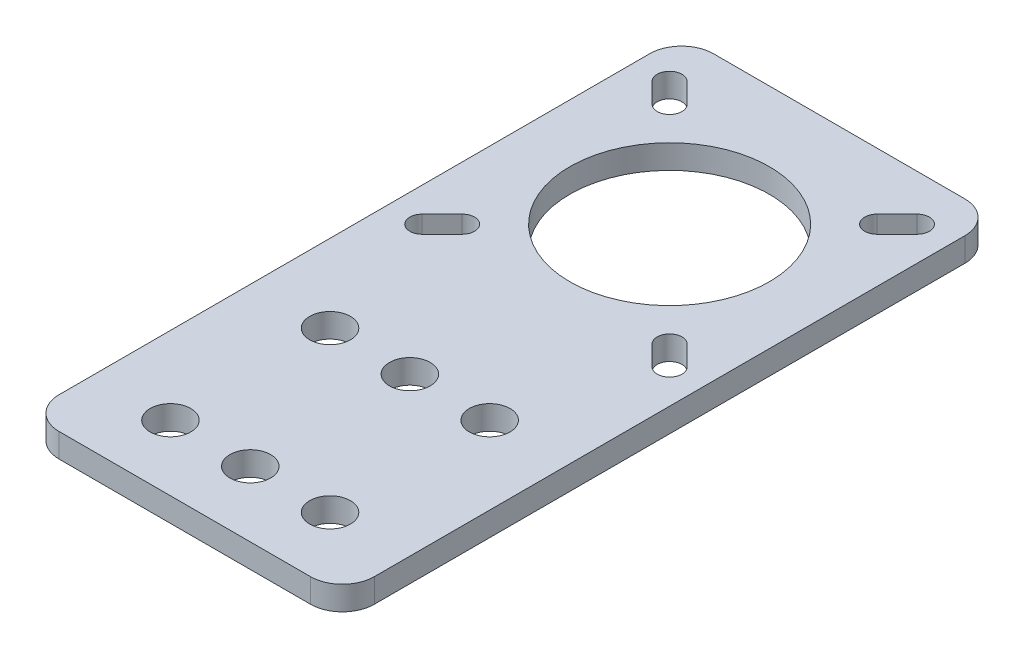
ISO-10303-21;
HEADER;
FILE_DESCRIPTION(('STEP AP214'),'2;1');
FILE_NAME('part.step','',(''),(''),'','','');
FILE_SCHEMA(('AUTOMOTIVE_DESIGN { 1 0 10303 214 1 1 1 1 }'));
ENDSEC;
DATA;
#1=APPLICATION_CONTEXT('core data for automotive mechanical design processes');
#2=APPLICATION_PROTOCOL_DEFINITION('international standard','automotive_design',2000,#1);
#3=PRODUCT_CONTEXT('',#1,'mechanical');
#4=PRODUCT('Part','Part','',(#3));
#5=PRODUCT_RELATED_PRODUCT_CATEGORY('part','',(#4));
#6=PRODUCT_DEFINITION_FORMATION('','',#4);
#7=PRODUCT_DEFINITION_CONTEXT('part definition',#1,'design');
#8=PRODUCT_DEFINITION('design','',#6,#7);
#9=PRODUCT_DEFINITION_SHAPE('','',#8);
#10=(LENGTH_UNIT() NAMED_UNIT(*) SI_UNIT(.MILLI.,.METRE.));
#11=(NAMED_UNIT(*) PLANE_ANGLE_UNIT() SI_UNIT($,.RADIAN.));
#12=(NAMED_UNIT(*) SI_UNIT($,.STERADIAN.) SOLID_ANGLE_UNIT());
#13=UNCERTAINTY_MEASURE_WITH_UNIT(LENGTH_MEASURE(1.E-05),#10,'distance_accuracy_value','');
#14=(GEOMETRIC_REPRESENTATION_CONTEXT(3) GLOBAL_UNCERTAINTY_ASSIGNED_CONTEXT((#13)) GLOBAL_UNIT_ASSIGNED_CONTEXT((#10,
#11,#12)) REPRESENTATION_CONTEXT('',''));
#15=CARTESIAN_POINT('',(0.,0.,0.));
#16=DIRECTION('',(0.,0.,1.));
#17=DIRECTION('',(1.,0.,0.));
#18=AXIS2_PLACEMENT_3D('',#15,#16,#17);
#19=CARTESIAN_POINT('',(-15.75,3.,56.75));
#20=DIRECTION('',(0.,-1.,0.));
#21=DIRECTION('',(0.,0.,-1.));
#22=AXIS2_PLACEMENT_3D('',#19,#20,#21);
#23=PLANE('',#22);
#24=CARTESIAN_POINT('',(-12.9999999999999,3.,13.));
#25=DIRECTION('',(0.,1.,0.));
#26=DIRECTION('',(0.,0.,1.));
#27=AXIS2_PLACEMENT_3D('',#24,#25,#26);
#28=CIRCLE('',#27,1.55);
#29=CARTESIAN_POINT('',(-11.9039844891608,3.,14.0960155108391));
#30=VERTEX_POINT('',#29);
#31=CARTESIAN_POINT('',(-14.0960155108391,3.,11.9039844891609));
#32=VERTEX_POINT('',#31);
#33=EDGE_CURVE('E231',#30,#32,#28,.T.);
#34=ORIENTED_EDGE('',*,*,#33,.F.);
#35=DIRECTION('',(0.707106781186545,0.,-0.70710678118655));
#36=VECTOR('',#35,1.);
#37=CARTESIAN_POINT('',(-11.9039844891608,3.,14.0960155108391));
#38=LINE('',#37,#36);
#39=CARTESIAN_POINT('',(-14.4039844891608,3.,16.5960155108392));
#40=VERTEX_POINT('',#39);
#41=EDGE_CURVE('E239',#40,#30,#38,.T.);
#42=ORIENTED_EDGE('',*,*,#41,.F.);
#43=CARTESIAN_POINT('',(-15.4999999999999,3.,15.5));
#44=DIRECTION('',(0.,1.,0.));
#45=DIRECTION('',(0.,0.,1.));
#46=AXIS2_PLACEMENT_3D('',#43,#44,#45);
#47=CIRCLE('',#46,1.55);
#48=CARTESIAN_POINT('',(-16.5960155108391,3.,14.4039844891608));
#49=VERTEX_POINT('',#48);
#50=EDGE_CURVE('E236',#49,#40,#47,.T.);
#51=ORIENTED_EDGE('',*,*,#50,.F.);
#52=DIRECTION('',(-0.707106781186545,0.,0.70710678118655));
#53=VECTOR('',#52,1.);
#54=CARTESIAN_POINT('',(-14.0960155108391,3.,11.9039844891609));
#55=LINE('',#54,#53);
#56=EDGE_CURVE('E233',#32,#49,#55,.T.);
#57=ORIENTED_EDGE('',*,*,#56,.F.);
#58=EDGE_LOOP('',(#34,#42,#51,#57));
#59=FACE_BOUND('',#58,.T.);
#60=CARTESIAN_POINT('',(-9.99999999999999,3.,32.55));
#61=DIRECTION('',(0.,1.,0.));
#62=DIRECTION('',(0.,0.,1.));
#63=AXIS2_PLACEMENT_3D('',#60,#61,#62);
#64=CIRCLE('',#63,2.55);
#65=CARTESIAN_POINT('',(-9.99999999999999,3.,35.1));
#66=VERTEX_POINT('',#65);
#67=EDGE_CURVE('E293',#66,#66,#64,.T.);
#68=ORIENTED_EDGE('',*,*,#67,.F.);
#69=EDGE_LOOP('',(#68));
#70=FACE_BOUND('',#69,.T.);
#71=CARTESIAN_POINT('',(0.,3.,32.55));
#72=DIRECTION('',(0.,1.,0.));
#73=DIRECTION('',(0.,0.,1.));
#74=AXIS2_PLACEMENT_3D('',#71,#72,#73);
#75=CIRCLE('',#74,2.55);
#76=CARTESIAN_POINT('',(0.,3.,35.1));
#77=VERTEX_POINT('',#76);
#78=EDGE_CURVE('E305',#77,#77,#75,.T.);
#79=ORIENTED_EDGE('',*,*,#78,.F.);
#80=EDGE_LOOP('',(#79));
#81=FACE_BOUND('',#80,.T.);
#82=CARTESIAN_POINT('',(10.,3.,32.55));
#83=DIRECTION('',(0.,1.,0.));
#84=DIRECTION('',(0.,0.,1.));
#85=AXIS2_PLACEMENT_3D('',#82,#83,#84);
#86=CIRCLE('',#85,2.55);
#87=CARTESIAN_POINT('',(10.,3.,35.1));
#88=VERTEX_POINT('',#87);
#89=EDGE_CURVE('E317',#88,#88,#86,.T.);
#90=ORIENTED_EDGE('',*,*,#89,.F.);
#91=EDGE_LOOP('',(#90));
#92=FACE_BOUND('',#91,.T.);
#93=CARTESIAN_POINT('',(12.9999999999999,3.,-13.));
#94=DIRECTION('',(0.,1.,0.));
#95=DIRECTION('',(0.,0.,1.));
#96=AXIS2_PLACEMENT_3D('',#93,#94,#95);
#97=CIRCLE('',#96,1.55);
#98=CARTESIAN_POINT('',(11.9039844891608,3.,-14.0960155108391));
#99=VERTEX_POINT('',#98);
#100=CARTESIAN_POINT('',(14.0960155108391,3.,-11.9039844891608));
#101=VERTEX_POINT('',#100);
#102=EDGE_CURVE('E329',#99,#101,#97,.T.);
#103=ORIENTED_EDGE('',*,*,#102,.F.);
#104=DIRECTION('',(-0.707106781186545,0.,0.70710678118655));
#105=VECTOR('',#104,1.);
#106=CARTESIAN_POINT('',(11.9039844891608,3.,-14.0960155108391));
#107=LINE('',#106,#105);
#108=CARTESIAN_POINT('',(14.4039844891608,3.,-16.5960155108391));
#109=VERTEX_POINT('',#108);
#110=EDGE_CURVE('E337',#109,#99,#107,.T.);
#111=ORIENTED_EDGE('',*,*,#110,.F.);
#112=CARTESIAN_POINT('',(15.4999999999999,3.,-15.5));
#113=DIRECTION('',(0.,1.,0.));
#114=DIRECTION('',(0.,0.,1.));
#115=AXIS2_PLACEMENT_3D('',#112,#113,#114);
#116=CIRCLE('',#115,1.55);
#117=CARTESIAN_POINT('',(16.5960155108391,3.,-14.4039844891608));
#118=VERTEX_POINT('',#117);
#119=EDGE_CURVE('E334',#118,#109,#116,.T.);
#120=ORIENTED_EDGE('',*,*,#119,.F.);
#121=DIRECTION('',(0.707106781186546,0.,-0.707106781186549));
#122=VECTOR('',#121,1.);
#123=CARTESIAN_POINT('',(14.0960155108391,3.,-11.9039844891608));
#124=LINE('',#123,#122);
#125=EDGE_CURVE('E331',#101,#118,#124,.T.);
#126=ORIENTED_EDGE('',*,*,#125,.F.);
#127=EDGE_LOOP('',(#103,#111,#120,#126));
#128=FACE_BOUND('',#127,.T.);
#129=CARTESIAN_POINT('',(-15.75,3.,56.75));
#130=DIRECTION('',(0.,1.,0.));
#131=DIRECTION('',(0.,0.,-1.));
#132=AXIS2_PLACEMENT_3D('',#129,#130,#131);
#133=CIRCLE('',#132,4.00000000000001);
#134=CARTESIAN_POINT('',(-19.75,3.,56.75));
#135=VERTEX_POINT('',#134);
#136=CARTESIAN_POINT('',(-15.75,3.,60.75));
#137=VERTEX_POINT('',#136);
#138=EDGE_CURVE('E366',#135,#137,#133,.T.);
#139=ORIENTED_EDGE('',*,*,#138,.T.);
#140=DIRECTION('',(1.,0.,0.));
#141=VECTOR('',#140,1.);
#142=CARTESIAN_POINT('',(15.75,3.,60.75));
#143=LINE('',#142,#141);
#144=CARTESIAN_POINT('',(15.75,3.,60.75));
#145=VERTEX_POINT('',#144);
#146=EDGE_CURVE('E369',#137,#145,#143,.T.);
#147=ORIENTED_EDGE('',*,*,#146,.T.);
#148=CARTESIAN_POINT('',(15.75,3.,56.75));
#149=DIRECTION('',(0.,1.,0.));
#150=DIRECTION('',(0.,0.,1.));
#151=AXIS2_PLACEMENT_3D('',#148,#149,#150);
#152=CIRCLE('',#151,4.00000000000001);
#153=CARTESIAN_POINT('',(19.75,3.,56.75));
#154=VERTEX_POINT('',#153);
#155=EDGE_CURVE('E372',#145,#154,#152,.T.);
#156=ORIENTED_EDGE('',*,*,#155,.T.);
#157=DIRECTION('',(0.,0.,-1.));
#158=VECTOR('',#157,1.);
#159=CARTESIAN_POINT('',(19.75,3.,56.75));
#160=LINE('',#159,#158);
#161=CARTESIAN_POINT('',(19.75,3.,-17.25));
#162=VERTEX_POINT('',#161);
#163=EDGE_CURVE('E374',#154,#162,#160,.T.);
#164=ORIENTED_EDGE('',*,*,#163,.T.);
#165=CARTESIAN_POINT('',(15.75,3.,-17.25));
#166=DIRECTION('',(0.,1.,0.));
#167=DIRECTION('',(0.,0.,1.));
#168=AXIS2_PLACEMENT_3D('',#165,#166,#167);
#169=CIRCLE('',#168,4.);
#170=CARTESIAN_POINT('',(15.75,3.,-21.25));
#171=VERTEX_POINT('',#170);
#172=EDGE_CURVE('E376',#162,#171,#169,.T.);
#173=ORIENTED_EDGE('',*,*,#172,.T.);
#174=DIRECTION('',(-1.,0.,0.));
#175=VECTOR('',#174,1.);
#176=CARTESIAN_POINT('',(15.75,3.,-21.25));
#177=LINE('',#176,#175);
#178=CARTESIAN_POINT('',(-15.75,3.,-21.25));
#179=VERTEX_POINT('',#178);
#180=EDGE_CURVE('E378',#171,#179,#177,.T.);
#181=ORIENTED_EDGE('',*,*,#180,.T.);
#182=CARTESIAN_POINT('',(-15.75,3.,-17.25));
#183=DIRECTION('',(0.,1.,0.));
#184=DIRECTION('',(0.,0.,1.));
#185=AXIS2_PLACEMENT_3D('',#182,#183,#184);
#186=CIRCLE('',#185,4.);
#187=CARTESIAN_POINT('',(-19.75,3.,-17.25));
#188=VERTEX_POINT('',#187);
#189=EDGE_CURVE('E380',#179,#188,#186,.T.);
#190=ORIENTED_EDGE('',*,*,#189,.T.);
#191=DIRECTION('',(0.,0.,1.));
#192=VECTOR('',#191,1.);
#193=CARTESIAN_POINT('',(-19.75,3.,56.75));
#194=LINE('',#193,#192);
#195=EDGE_CURVE('E382',#188,#135,#194,.T.);
#196=ORIENTED_EDGE('',*,*,#195,.T.);
#197=EDGE_LOOP('',(#139,#147,#156,#164,#173,#181,#190,#196));
#198=FACE_BOUND('',#197,.T.);
#199=CARTESIAN_POINT('',(0.,3.,0.));
#200=DIRECTION('',(0.,1.,0.));
#201=DIRECTION('',(0.,0.,1.));
#202=AXIS2_PLACEMENT_3D('',#199,#200,#201);
#203=CIRCLE('',#202,12.5);
#204=CARTESIAN_POINT('',(0.,3.,12.5));
#205=VERTEX_POINT('',#204);
#206=EDGE_CURVE('E360',#205,#205,#203,.T.);
#207=ORIENTED_EDGE('',*,*,#206,.F.);
#208=EDGE_LOOP('',(#207));
#209=FACE_BOUND('',#208,.T.);
#210=CARTESIAN_POINT('',(10.,3.,52.55));
#211=DIRECTION('',(0.,1.,0.));
#212=DIRECTION('',(0.,0.,1.));
#213=AXIS2_PLACEMENT_3D('',#210,#211,#212);
#214=CIRCLE('',#213,2.55);
#215=CARTESIAN_POINT('',(10.,3.,55.1));
#216=VERTEX_POINT('',#215);
#217=EDGE_CURVE('E323',#216,#216,#214,.T.);
#218=ORIENTED_EDGE('',*,*,#217,.F.);
#219=EDGE_LOOP('',(#218));
#220=FACE_BOUND('',#219,.T.);
#221=CARTESIAN_POINT('',(0.,3.,52.55));
#222=DIRECTION('',(0.,1.,0.));
#223=DIRECTION('',(0.,0.,1.));
#224=AXIS2_PLACEMENT_3D('',#221,#222,#223);
#225=CIRCLE('',#224,2.55);
#226=CARTESIAN_POINT('',(0.,3.,55.1));
#227=VERTEX_POINT('',#226);
#228=EDGE_CURVE('E311',#227,#227,#225,.T.);
#229=ORIENTED_EDGE('',*,*,#228,.F.);
#230=EDGE_LOOP('',(#229));
#231=FACE_BOUND('',#230,.T.);
#232=CARTESIAN_POINT('',(-9.99999999999999,3.,52.55));
#233=DIRECTION('',(0.,1.,0.));
#234=DIRECTION('',(0.,0.,1.));
#235=AXIS2_PLACEMENT_3D('',#232,#233,#234);
#236=CIRCLE('',#235,2.55);
#237=CARTESIAN_POINT('',(-9.99999999999999,3.,55.1));
#238=VERTEX_POINT('',#237);
#239=EDGE_CURVE('E299',#238,#238,#236,.T.);
#240=ORIENTED_EDGE('',*,*,#239,.F.);
#241=EDGE_LOOP('',(#240));
#242=FACE_BOUND('',#241,.T.);
#243=CARTESIAN_POINT('',(-12.9999999999999,3.,-13.));
#244=DIRECTION('',(0.,1.,0.));
#245=DIRECTION('',(0.,0.,-1.));
#246=AXIS2_PLACEMENT_3D('',#243,#244,#245);
#247=CIRCLE('',#246,1.55);
#248=CARTESIAN_POINT('',(-14.0960155108391,3.,-11.9039844891609));
#249=VERTEX_POINT('',#248);
#250=CARTESIAN_POINT('',(-11.9039844891608,3.,-14.0960155108391));
#251=VERTEX_POINT('',#250);
#252=EDGE_CURVE('E262',#249,#251,#247,.T.);
#253=ORIENTED_EDGE('',*,*,#252,.F.);
#254=DIRECTION('',(0.707106781186545,0.,0.70710678118655));
#255=VECTOR('',#254,1.);
#256=CARTESIAN_POINT('',(-14.0960155108391,3.,-11.9039844891609));
#257=LINE('',#256,#255);
#258=CARTESIAN_POINT('',(-16.5960155108391,3.,-14.4039844891609));
#259=VERTEX_POINT('',#258);
#260=EDGE_CURVE('E270',#259,#249,#257,.T.);
#261=ORIENTED_EDGE('',*,*,#260,.F.);
#262=CARTESIAN_POINT('',(-15.4999999999999,3.,-15.5));
#263=DIRECTION('',(0.,1.,0.));
#264=DIRECTION('',(0.,0.,-1.));
#265=AXIS2_PLACEMENT_3D('',#262,#263,#264);
#266=CIRCLE('',#265,1.55);
#267=CARTESIAN_POINT('',(-14.4039844891608,3.,-16.5960155108391));
#268=VERTEX_POINT('',#267);
#269=EDGE_CURVE('E267',#268,#259,#266,.T.);
#270=ORIENTED_EDGE('',*,*,#269,.F.);
#271=DIRECTION('',(-0.707106781186545,0.,-0.70710678118655));
#272=VECTOR('',#271,1.);
#273=CARTESIAN_POINT('',(-11.9039844891608,3.,-14.0960155108391));
#274=LINE('',#273,#272);
#275=EDGE_CURVE('E264',#251,#268,#274,.T.);
#276=ORIENTED_EDGE('',*,*,#275,.F.);
#277=EDGE_LOOP('',(#253,#261,#270,#276));
#278=FACE_BOUND('',#277,.T.);
#279=CARTESIAN_POINT('',(12.9999999999999,3.,13.));
#280=DIRECTION('',(0.,1.,0.));
#281=DIRECTION('',(0.,0.,-1.));
#282=AXIS2_PLACEMENT_3D('',#279,#280,#281);
#283=CIRCLE('',#282,1.55);
#284=CARTESIAN_POINT('',(14.0960155108391,3.,11.9039844891608));
#285=VERTEX_POINT('',#284);
#286=CARTESIAN_POINT('',(11.9039844891608,3.,14.0960155108391));
#287=VERTEX_POINT('',#286);
#288=EDGE_CURVE('E195',#285,#287,#283,.T.);
#289=ORIENTED_EDGE('',*,*,#288,.F.);
#290=DIRECTION('',(-0.707106781186546,0.,-0.707106781186549));
#291=VECTOR('',#290,1.);
#292=CARTESIAN_POINT('',(14.0960155108391,3.,11.9039844891608));
#293=LINE('',#292,#291);
#294=CARTESIAN_POINT('',(16.5960155108391,3.,14.4039844891608));
#295=VERTEX_POINT('',#294);
#296=EDGE_CURVE('E217',#295,#285,#293,.T.);
#297=ORIENTED_EDGE('',*,*,#296,.F.);
#298=CARTESIAN_POINT('',(15.4999999999999,3.,15.5));
#299=DIRECTION('',(0.,1.,0.));
#300=DIRECTION('',(0.,0.,-1.));
#301=AXIS2_PLACEMENT_3D('',#298,#299,#300);
#302=CIRCLE('',#301,1.55);
#303=CARTESIAN_POINT('',(14.4039844891608,3.,16.5960155108391));
#304=VERTEX_POINT('',#303);
#305=EDGE_CURVE('E215',#304,#295,#302,.T.);
#306=ORIENTED_EDGE('',*,*,#305,.F.);
#307=DIRECTION('',(0.707106781186545,0.,0.70710678118655));
#308=VECTOR('',#307,1.);
#309=CARTESIAN_POINT('',(11.9039844891608,3.,14.0960155108391));
#310=LINE('',#309,#308);
#311=EDGE_CURVE('E203',#287,#304,#310,.T.);
#312=ORIENTED_EDGE('',*,*,#311,.F.);
#313=EDGE_LOOP('',(#289,#297,#306,#312));
#314=FACE_BOUND('',#313,.T.);
#315=ADVANCED_FACE('F34',(#59,#70,#81,#92,#128,#198,#209,#220,#231,#242,#278,#314),#23,.F.);
#316=CARTESIAN_POINT('',(-15.75,0.,56.75));
#317=DIRECTION('',(0.,-1.,0.));
#318=DIRECTION('',(0.,0.,-1.));
#319=AXIS2_PLACEMENT_3D('',#316,#317,#318);
#320=PLANE('',#319);
#321=DIRECTION('',(0.707106781186545,0.,-0.70710678118655));
#322=VECTOR('',#321,1.);
#323=CARTESIAN_POINT('',(-11.9039844891608,0.,14.0960155108391));
#324=LINE('',#323,#322);
#325=CARTESIAN_POINT('',(-14.4039844891608,0.,16.5960155108391));
#326=VERTEX_POINT('',#325);
#327=CARTESIAN_POINT('',(-11.9039844891608,0.,14.0960155108391));
#328=VERTEX_POINT('',#327);
#329=EDGE_CURVE('E234',#326,#328,#324,.T.);
#330=ORIENTED_EDGE('',*,*,#329,.T.);
#331=CARTESIAN_POINT('',(-12.9999999999999,0.,13.));
#332=DIRECTION('',(0.,1.,0.));
#333=DIRECTION('',(0.,0.,1.));
#334=AXIS2_PLACEMENT_3D('',#331,#332,#333);
#335=CIRCLE('',#334,1.55);
#336=CARTESIAN_POINT('',(-14.0960155108391,0.,11.9039844891609));
#337=VERTEX_POINT('',#336);
#338=EDGE_CURVE('E211',#328,#337,#335,.T.);
#339=ORIENTED_EDGE('',*,*,#338,.T.);
#340=DIRECTION('',(-0.707106781186545,0.,0.70710678118655));
#341=VECTOR('',#340,1.);
#342=CARTESIAN_POINT('',(-14.0960155108391,0.,11.9039844891609));
#343=LINE('',#342,#341);
#344=CARTESIAN_POINT('',(-16.5960155108391,0.,14.4039844891608));
#345=VERTEX_POINT('',#344);
#346=EDGE_CURVE('E244',#337,#345,#343,.T.);
#347=ORIENTED_EDGE('',*,*,#346,.T.);
#348=CARTESIAN_POINT('',(-15.4999999999999,0.,15.5));
#349=DIRECTION('',(0.,1.,0.));
#350=DIRECTION('',(0.,0.,1.));
#351=AXIS2_PLACEMENT_3D('',#348,#349,#350);
#352=CIRCLE('',#351,1.55);
#353=EDGE_CURVE('E247',#345,#326,#352,.T.);
#354=ORIENTED_EDGE('',*,*,#353,.T.);
#355=EDGE_LOOP('',(#330,#339,#347,#354));
#356=FACE_BOUND('',#355,.T.);
#357=CARTESIAN_POINT('',(-9.99999999999999,0.,32.55));
#358=DIRECTION('',(0.,1.,0.));
#359=DIRECTION('',(0.,0.,1.));
#360=AXIS2_PLACEMENT_3D('',#357,#358,#359);
#361=CIRCLE('',#360,2.55);
#362=CARTESIAN_POINT('',(-9.99999999999999,0.,35.1));
#363=VERTEX_POINT('',#362);
#364=EDGE_CURVE('E292',#363,#363,#361,.T.);
#365=ORIENTED_EDGE('',*,*,#364,.T.);
#366=EDGE_LOOP('',(#365));
#367=FACE_BOUND('',#366,.T.);
#368=CARTESIAN_POINT('',(0.,0.,32.55));
#369=DIRECTION('',(0.,1.,0.));
#370=DIRECTION('',(0.,0.,1.));
#371=AXIS2_PLACEMENT_3D('',#368,#369,#370);
#372=CIRCLE('',#371,2.55);
#373=CARTESIAN_POINT('',(0.,0.,35.1));
#374=VERTEX_POINT('',#373);
#375=EDGE_CURVE('E302',#374,#374,#372,.T.);
#376=ORIENTED_EDGE('',*,*,#375,.T.);
#377=EDGE_LOOP('',(#376));
#378=FACE_BOUND('',#377,.T.);
#379=CARTESIAN_POINT('',(10.,0.,32.55));
#380=DIRECTION('',(0.,1.,0.));
#381=DIRECTION('',(0.,0.,1.));
#382=AXIS2_PLACEMENT_3D('',#379,#380,#381);
#383=CIRCLE('',#382,2.55);
#384=CARTESIAN_POINT('',(10.,0.,35.1));
#385=VERTEX_POINT('',#384);
#386=EDGE_CURVE('E314',#385,#385,#383,.T.);
#387=ORIENTED_EDGE('',*,*,#386,.T.);
#388=EDGE_LOOP('',(#387));
#389=FACE_BOUND('',#388,.T.);
#390=DIRECTION('',(-0.707106781186545,0.,0.70710678118655));
#391=VECTOR('',#390,1.);
#392=CARTESIAN_POINT('',(11.9039844891608,0.,-14.0960155108391));
#393=LINE('',#392,#391);
#394=CARTESIAN_POINT('',(14.4039844891608,0.,-16.5960155108391));
#395=VERTEX_POINT('',#394);
#396=CARTESIAN_POINT('',(11.9039844891608,0.,-14.0960155108391));
#397=VERTEX_POINT('',#396);
#398=EDGE_CURVE('E332',#395,#397,#393,.T.);
#399=ORIENTED_EDGE('',*,*,#398,.T.);
#400=CARTESIAN_POINT('',(12.9999999999999,0.,-13.));
#401=DIRECTION('',(0.,1.,0.));
#402=DIRECTION('',(0.,0.,1.));
#403=AXIS2_PLACEMENT_3D('',#400,#401,#402);
#404=CIRCLE('',#403,1.55);
#405=CARTESIAN_POINT('',(14.0960155108391,0.,-11.9039844891608));
#406=VERTEX_POINT('',#405);
#407=EDGE_CURVE('E326',#397,#406,#404,.T.);
#408=ORIENTED_EDGE('',*,*,#407,.T.);
#409=DIRECTION('',(0.707106781186546,0.,-0.707106781186549));
#410=VECTOR('',#409,1.);
#411=CARTESIAN_POINT('',(14.0960155108391,0.,-11.9039844891608));
#412=LINE('',#411,#410);
#413=CARTESIAN_POINT('',(16.5960155108391,0.,-14.4039844891608));
#414=VERTEX_POINT('',#413);
#415=EDGE_CURVE('E342',#406,#414,#412,.T.);
#416=ORIENTED_EDGE('',*,*,#415,.T.);
#417=CARTESIAN_POINT('',(15.4999999999999,0.,-15.5));
#418=DIRECTION('',(0.,1.,0.));
#419=DIRECTION('',(0.,0.,1.));
#420=AXIS2_PLACEMENT_3D('',#417,#418,#419);
#421=CIRCLE('',#420,1.55);
#422=EDGE_CURVE('E345',#414,#395,#421,.T.);
#423=ORIENTED_EDGE('',*,*,#422,.T.);
#424=EDGE_LOOP('',(#399,#408,#416,#423));
#425=FACE_BOUND('',#424,.T.);
#426=CARTESIAN_POINT('',(-15.75,0.,56.75));
#427=DIRECTION('',(0.,1.,0.));
#428=DIRECTION('',(0.,0.,-1.));
#429=AXIS2_PLACEMENT_3D('',#426,#427,#428);
#430=CIRCLE('',#429,4.00000000000001);
#431=CARTESIAN_POINT('',(-19.75,0.,56.75));
#432=VERTEX_POINT('',#431);
#433=CARTESIAN_POINT('',(-15.75,0.,60.75));
#434=VERTEX_POINT('',#433);
#435=EDGE_CURVE('E363',#432,#434,#430,.T.);
#436=ORIENTED_EDGE('',*,*,#435,.F.);
#437=DIRECTION('',(0.,0.,1.));
#438=VECTOR('',#437,1.);
#439=CARTESIAN_POINT('',(-19.75,0.,56.75));
#440=LINE('',#439,#438);
#441=CARTESIAN_POINT('',(-19.75,0.,-17.25));
#442=VERTEX_POINT('',#441);
#443=EDGE_CURVE('E370',#442,#432,#440,.T.);
#444=ORIENTED_EDGE('',*,*,#443,.F.);
#445=CARTESIAN_POINT('',(-15.75,0.,-17.25));
#446=DIRECTION('',(0.,1.,0.));
#447=DIRECTION('',(0.,0.,1.));
#448=AXIS2_PLACEMENT_3D('',#445,#446,#447);
#449=CIRCLE('',#448,4.);
#450=CARTESIAN_POINT('',(-15.75,0.,-21.25));
#451=VERTEX_POINT('',#450);
#452=EDGE_CURVE('E397',#451,#442,#449,.T.);
#453=ORIENTED_EDGE('',*,*,#452,.F.);
#454=DIRECTION('',(-1.,0.,0.));
#455=VECTOR('',#454,1.);
#456=CARTESIAN_POINT('',(15.75,0.,-21.25));
#457=LINE('',#456,#455);
#458=CARTESIAN_POINT('',(15.75,0.,-21.25));
#459=VERTEX_POINT('',#458);
#460=EDGE_CURVE('E395',#459,#451,#457,.T.);
#461=ORIENTED_EDGE('',*,*,#460,.F.);
#462=CARTESIAN_POINT('',(15.75,0.,-17.25));
#463=DIRECTION('',(0.,1.,0.));
#464=DIRECTION('',(0.,0.,1.));
#465=AXIS2_PLACEMENT_3D('',#462,#463,#464);
#466=CIRCLE('',#465,4.);
#467=CARTESIAN_POINT('',(19.75,0.,-17.25));
#468=VERTEX_POINT('',#467);
#469=EDGE_CURVE('E393',#468,#459,#466,.T.);
#470=ORIENTED_EDGE('',*,*,#469,.F.);
#471=DIRECTION('',(0.,0.,-1.));
#472=VECTOR('',#471,1.);
#473=CARTESIAN_POINT('',(19.75,0.,56.75));
#474=LINE('',#473,#472);
#475=CARTESIAN_POINT('',(19.75,0.,56.75));
#476=VERTEX_POINT('',#475);
#477=EDGE_CURVE('E391',#476,#468,#474,.T.);
#478=ORIENTED_EDGE('',*,*,#477,.F.);
#479=CARTESIAN_POINT('',(15.75,0.,56.75));
#480=DIRECTION('',(0.,1.,0.));
#481=DIRECTION('',(0.,0.,1.));
#482=AXIS2_PLACEMENT_3D('',#479,#480,#481);
#483=CIRCLE('',#482,4.00000000000001);
#484=CARTESIAN_POINT('',(15.75,0.,60.75));
#485=VERTEX_POINT('',#484);
#486=EDGE_CURVE('E389',#485,#476,#483,.T.);
#487=ORIENTED_EDGE('',*,*,#486,.F.);
#488=DIRECTION('',(1.,0.,0.));
#489=VECTOR('',#488,1.);
#490=CARTESIAN_POINT('',(15.75,0.,60.75));
#491=LINE('',#490,#489);
#492=EDGE_CURVE('E387',#434,#485,#491,.T.);
#493=ORIENTED_EDGE('',*,*,#492,.F.);
#494=EDGE_LOOP('',(#436,#444,#453,#461,#470,#478,#487,#493));
#495=FACE_BOUND('',#494,.T.);
#496=CARTESIAN_POINT('',(0.,0.,0.));
#497=DIRECTION('',(0.,1.,0.));
#498=DIRECTION('',(0.,0.,1.));
#499=AXIS2_PLACEMENT_3D('',#496,#497,#498);
#500=CIRCLE('',#499,12.5);
#501=CARTESIAN_POINT('',(0.,0.,12.5));
#502=VERTEX_POINT('',#501);
#503=EDGE_CURVE('E359',#502,#502,#500,.T.);
#504=ORIENTED_EDGE('',*,*,#503,.T.);
#505=EDGE_LOOP('',(#504));
#506=FACE_BOUND('',#505,.T.);
#507=CARTESIAN_POINT('',(10.,0.,52.55));
#508=DIRECTION('',(0.,1.,0.));
#509=DIRECTION('',(0.,0.,1.));
#510=AXIS2_PLACEMENT_3D('',#507,#508,#509);
#511=CIRCLE('',#510,2.55);
#512=CARTESIAN_POINT('',(10.,0.,55.1));
#513=VERTEX_POINT('',#512);
#514=EDGE_CURVE('E320',#513,#513,#511,.T.);
#515=ORIENTED_EDGE('',*,*,#514,.T.);
#516=EDGE_LOOP('',(#515));
#517=FACE_BOUND('',#516,.T.);
#518=CARTESIAN_POINT('',(0.,0.,52.55));
#519=DIRECTION('',(0.,1.,0.));
#520=DIRECTION('',(0.,0.,1.));
#521=AXIS2_PLACEMENT_3D('',#518,#519,#520);
#522=CIRCLE('',#521,2.55);
#523=CARTESIAN_POINT('',(0.,0.,55.1));
#524=VERTEX_POINT('',#523);
#525=EDGE_CURVE('E308',#524,#524,#522,.T.);
#526=ORIENTED_EDGE('',*,*,#525,.T.);
#527=EDGE_LOOP('',(#526));
#528=FACE_BOUND('',#527,.T.);
#529=CARTESIAN_POINT('',(-9.99999999999999,0.,52.55));
#530=DIRECTION('',(0.,1.,0.));
#531=DIRECTION('',(0.,0.,1.));
#532=AXIS2_PLACEMENT_3D('',#529,#530,#531);
#533=CIRCLE('',#532,2.55);
#534=CARTESIAN_POINT('',(-9.99999999999999,0.,55.1));
#535=VERTEX_POINT('',#534);
#536=EDGE_CURVE('E296',#535,#535,#533,.T.);
#537=ORIENTED_EDGE('',*,*,#536,.T.);
#538=EDGE_LOOP('',(#537));
#539=FACE_BOUND('',#538,.T.);
#540=DIRECTION('',(0.707106781186545,0.,0.70710678118655));
#541=VECTOR('',#540,1.);
#542=CARTESIAN_POINT('',(-14.0960155108391,0.,-11.9039844891609));
#543=LINE('',#542,#541);
#544=CARTESIAN_POINT('',(-16.5960155108391,0.,-14.4039844891608));
#545=VERTEX_POINT('',#544);
#546=CARTESIAN_POINT('',(-14.0960155108391,0.,-11.9039844891609));
#547=VERTEX_POINT('',#546);
#548=EDGE_CURVE('E265',#545,#547,#543,.T.);
#549=ORIENTED_EDGE('',*,*,#548,.T.);
#550=CARTESIAN_POINT('',(-12.9999999999999,0.,-13.));
#551=DIRECTION('',(0.,1.,0.));
#552=DIRECTION('',(0.,0.,-1.));
#553=AXIS2_PLACEMENT_3D('',#550,#551,#552);
#554=CIRCLE('',#553,1.55);
#555=CARTESIAN_POINT('',(-11.9039844891608,0.,-14.0960155108391));
#556=VERTEX_POINT('',#555);
#557=EDGE_CURVE('E261',#547,#556,#554,.T.);
#558=ORIENTED_EDGE('',*,*,#557,.T.);
#559=DIRECTION('',(-0.707106781186545,0.,-0.70710678118655));
#560=VECTOR('',#559,1.);
#561=CARTESIAN_POINT('',(-11.9039844891608,0.,-14.0960155108391));
#562=LINE('',#561,#560);
#563=CARTESIAN_POINT('',(-14.4039844891608,0.,-16.5960155108391));
#564=VERTEX_POINT('',#563);
#565=EDGE_CURVE('E275',#556,#564,#562,.T.);
#566=ORIENTED_EDGE('',*,*,#565,.T.);
#567=CARTESIAN_POINT('',(-15.4999999999999,0.,-15.5));
#568=DIRECTION('',(0.,1.,0.));
#569=DIRECTION('',(0.,0.,-1.));
#570=AXIS2_PLACEMENT_3D('',#567,#568,#569);
#571=CIRCLE('',#570,1.55);
#572=EDGE_CURVE('E278',#564,#545,#571,.T.);
#573=ORIENTED_EDGE('',*,*,#572,.T.);
#574=EDGE_LOOP('',(#549,#558,#566,#573));
#575=FACE_BOUND('',#574,.T.);
#576=DIRECTION('',(-0.707106781186546,0.,-0.707106781186549));
#577=VECTOR('',#576,1.);
#578=CARTESIAN_POINT('',(14.0960155108391,0.,11.9039844891608));
#579=LINE('',#578,#577);
#580=CARTESIAN_POINT('',(16.5960155108391,0.,14.4039844891608));
#581=VERTEX_POINT('',#580);
#582=CARTESIAN_POINT('',(14.0960155108391,0.,11.9039844891608));
#583=VERTEX_POINT('',#582);
#584=EDGE_CURVE('E204',#581,#583,#579,.T.);
#585=ORIENTED_EDGE('',*,*,#584,.T.);
#586=CARTESIAN_POINT('',(12.9999999999999,0.,13.));
#587=DIRECTION('',(0.,1.,0.));
#588=DIRECTION('',(0.,0.,-1.));
#589=AXIS2_PLACEMENT_3D('',#586,#587,#588);
#590=CIRCLE('',#589,1.55);
#591=CARTESIAN_POINT('',(11.9039844891608,0.,14.0960155108391));
#592=VERTEX_POINT('',#591);
#593=EDGE_CURVE('E57',#583,#592,#590,.T.);
#594=ORIENTED_EDGE('',*,*,#593,.T.);
#595=DIRECTION('',(0.707106781186545,0.,0.70710678118655));
#596=VECTOR('',#595,1.);
#597=CARTESIAN_POINT('',(11.9039844891608,0.,14.0960155108391));
#598=LINE('',#597,#596);
#599=CARTESIAN_POINT('',(14.4039844891608,0.,16.5960155108391));
#600=VERTEX_POINT('',#599);
#601=EDGE_CURVE('E210',#592,#600,#598,.T.);
#602=ORIENTED_EDGE('',*,*,#601,.T.);
#603=CARTESIAN_POINT('',(15.4999999999999,0.,15.5));
#604=DIRECTION('',(0.,1.,0.));
#605=DIRECTION('',(0.,0.,-1.));
#606=AXIS2_PLACEMENT_3D('',#603,#604,#605);
#607=CIRCLE('',#606,1.55);
#608=EDGE_CURVE('E223',#600,#581,#607,.T.);
#609=ORIENTED_EDGE('',*,*,#608,.T.);
#610=EDGE_LOOP('',(#585,#594,#602,#609));
#611=FACE_BOUND('',#610,.T.);
#612=ADVANCED_FACE('F427',(#356,#367,#378,#389,#425,#495,#506,#517,#528,#539,#575,#611),#320,.T.);
#613=CARTESIAN_POINT('',(-15.75,3.,56.75));
#614=DIRECTION('',(0.,-1.,0.));
#615=DIRECTION('',(0.,0.,-1.));
#616=AXIS2_PLACEMENT_3D('',#613,#614,#615);
#617=CYLINDRICAL_SURFACE('',#616,4.00000000000001);
#618=ORIENTED_EDGE('',*,*,#435,.T.);
#619=DIRECTION('',(0.,-1.,0.));
#620=VECTOR('',#619,1.);
#621=CARTESIAN_POINT('',(-15.75,3.,60.75));
#622=LINE('',#621,#620);
#623=EDGE_CURVE('E11',#137,#434,#622,.T.);
#624=ORIENTED_EDGE('',*,*,#623,.F.);
#625=ORIENTED_EDGE('',*,*,#138,.F.);
#626=DIRECTION('',(0.,-1.,0.));
#627=VECTOR('',#626,1.);
#628=CARTESIAN_POINT('',(-19.75,3.,56.75));
#629=LINE('',#628,#627);
#630=EDGE_CURVE('E384',#135,#432,#629,.T.);
#631=ORIENTED_EDGE('',*,*,#630,.T.);
#632=EDGE_LOOP('',(#618,#624,#625,#631));
#633=FACE_BOUND('',#632,.T.);
#634=ADVANCED_FACE('F36',(#633),#617,.T.);
#635=CARTESIAN_POINT('',(15.75,3.,60.75));
#636=DIRECTION('',(0.,0.,-1.));
#637=DIRECTION('',(-1.,0.,0.));
#638=AXIS2_PLACEMENT_3D('',#635,#636,#637);
#639=PLANE('',#638);
#640=ORIENTED_EDGE('',*,*,#492,.T.);
#641=DIRECTION('',(0.,-1.,0.));
#642=VECTOR('',#641,1.);
#643=CARTESIAN_POINT('',(15.75,3.,60.75));
#644=LINE('',#643,#642);
#645=EDGE_CURVE('E42',#145,#485,#644,.T.);
#646=ORIENTED_EDGE('',*,*,#645,.F.);
#647=ORIENTED_EDGE('',*,*,#146,.F.);
#648=ORIENTED_EDGE('',*,*,#623,.T.);
#649=EDGE_LOOP('',(#640,#646,#647,#648));
#650=FACE_BOUND('',#649,.T.);
#651=ADVANCED_FACE('F445',(#650),#639,.F.);
#652=CARTESIAN_POINT('',(15.75,3.,56.75));
#653=DIRECTION('',(0.,-1.,0.));
#654=DIRECTION('',(0.,0.,-1.));
#655=AXIS2_PLACEMENT_3D('',#652,#653,#654);
#656=CYLINDRICAL_SURFACE('',#655,4.00000000000001);
#657=ORIENTED_EDGE('',*,*,#486,.T.);
#658=DIRECTION('',(0.,-1.,0.));
#659=VECTOR('',#658,1.);
#660=CARTESIAN_POINT('',(19.75,3.,56.75));
#661=LINE('',#660,#659);
#662=EDGE_CURVE('E414',#154,#476,#661,.T.);
#663=ORIENTED_EDGE('',*,*,#662,.F.);
#664=ORIENTED_EDGE('',*,*,#155,.F.);
#665=ORIENTED_EDGE('',*,*,#645,.T.);
#666=EDGE_LOOP('',(#657,#663,#664,#665));
#667=FACE_BOUND('',#666,.T.);
#668=ADVANCED_FACE('F421',(#667),#656,.T.);
#669=CARTESIAN_POINT('',(19.75,3.,56.75));
#670=DIRECTION('',(-1.,0.,0.));
#671=DIRECTION('',(0.,0.,1.));
#672=AXIS2_PLACEMENT_3D('',#669,#670,#671);
#673=PLANE('',#672);
#674=ORIENTED_EDGE('',*,*,#477,.T.);
#675=DIRECTION('',(0.,-1.,0.));
#676=VECTOR('',#675,1.);
#677=CARTESIAN_POINT('',(19.75,3.,-17.25));
#678=LINE('',#677,#676);
#679=EDGE_CURVE('E411',#162,#468,#678,.T.);
#680=ORIENTED_EDGE('',*,*,#679,.F.);
#681=ORIENTED_EDGE('',*,*,#163,.F.);
#682=ORIENTED_EDGE('',*,*,#662,.T.);
#683=EDGE_LOOP('',(#674,#680,#681,#682));
#684=FACE_BOUND('',#683,.T.);
#685=ADVANCED_FACE('F433',(#684),#673,.F.);
#686=CARTESIAN_POINT('',(15.75,3.,-17.25));
#687=DIRECTION('',(0.,-1.,0.));
#688=DIRECTION('',(0.,0.,-1.));
#689=AXIS2_PLACEMENT_3D('',#686,#687,#688);
#690=CYLINDRICAL_SURFACE('',#689,4.);
#691=ORIENTED_EDGE('',*,*,#469,.T.);
#692=DIRECTION('',(0.,-1.,0.));
#693=VECTOR('',#692,1.);
#694=CARTESIAN_POINT('',(15.75,3.,-21.25));
#695=LINE('',#694,#693);
#696=EDGE_CURVE('E408',#171,#459,#695,.T.);
#697=ORIENTED_EDGE('',*,*,#696,.F.);
#698=ORIENTED_EDGE('',*,*,#172,.F.);
#699=ORIENTED_EDGE('',*,*,#679,.T.);
#700=EDGE_LOOP('',(#691,#697,#698,#699));
#701=FACE_BOUND('',#700,.T.);
#702=ADVANCED_FACE('F437',(#701),#690,.T.);
#703=CARTESIAN_POINT('',(15.75,3.,-21.25));
#704=DIRECTION('',(0.,0.,1.));
#705=DIRECTION('',(1.,0.,0.));
#706=AXIS2_PLACEMENT_3D('',#703,#704,#705);
#707=PLANE('',#706);
#708=ORIENTED_EDGE('',*,*,#460,.T.);
#709=DIRECTION('',(0.,-1.,0.));
#710=VECTOR('',#709,1.);
#711=CARTESIAN_POINT('',(-15.75,3.,-21.25));
#712=LINE('',#711,#710);
#713=EDGE_CURVE('E405',#179,#451,#712,.T.);
#714=ORIENTED_EDGE('',*,*,#713,.F.);
#715=ORIENTED_EDGE('',*,*,#180,.F.);
#716=ORIENTED_EDGE('',*,*,#696,.T.);
#717=EDGE_LOOP('',(#708,#714,#715,#716));
#718=FACE_BOUND('',#717,.T.);
#719=ADVANCED_FACE('F458',(#718),#707,.F.);
#720=CARTESIAN_POINT('',(-15.75,3.,-17.25));
#721=DIRECTION('',(0.,-1.,0.));
#722=DIRECTION('',(0.,0.,-1.));
#723=AXIS2_PLACEMENT_3D('',#720,#721,#722);
#724=CYLINDRICAL_SURFACE('',#723,4.);
#725=ORIENTED_EDGE('',*,*,#452,.T.);
#726=DIRECTION('',(0.,-1.,0.));
#727=VECTOR('',#726,1.);
#728=CARTESIAN_POINT('',(-19.75,3.,-17.25));
#729=LINE('',#728,#727);
#730=EDGE_CURVE('E402',#188,#442,#729,.T.);
#731=ORIENTED_EDGE('',*,*,#730,.F.);
#732=ORIENTED_EDGE('',*,*,#189,.F.);
#733=ORIENTED_EDGE('',*,*,#713,.T.);
#734=EDGE_LOOP('',(#725,#731,#732,#733));
#735=FACE_BOUND('',#734,.T.);
#736=ADVANCED_FACE('F456',(#735),#724,.T.);
#737=CARTESIAN_POINT('',(-19.75,3.,56.75));
#738=DIRECTION('',(1.,0.,0.));
#739=DIRECTION('',(0.,0.,-1.));
#740=AXIS2_PLACEMENT_3D('',#737,#738,#739);
#741=PLANE('',#740);
#742=ORIENTED_EDGE('',*,*,#443,.T.);
#743=ORIENTED_EDGE('',*,*,#630,.F.);
#744=ORIENTED_EDGE('',*,*,#195,.F.);
#745=ORIENTED_EDGE('',*,*,#730,.T.);
#746=EDGE_LOOP('',(#742,#743,#744,#745));
#747=FACE_BOUND('',#746,.T.);
#748=ADVANCED_FACE('F451',(#747),#741,.F.);
#749=CARTESIAN_POINT('',(0.,3.,0.));
#750=DIRECTION('',(0.,-1.,0.));
#751=DIRECTION('',(0.,0.,-1.));
#752=AXIS2_PLACEMENT_3D('',#749,#750,#751);
#753=CYLINDRICAL_SURFACE('',#752,12.5);
#754=ORIENTED_EDGE('',*,*,#206,.T.);
#755=EDGE_LOOP('',(#754));
#756=FACE_BOUND('',#755,.T.);
#757=ORIENTED_EDGE('',*,*,#503,.F.);
#758=EDGE_LOOP('',(#757));
#759=FACE_BOUND('',#758,.T.);
#760=ADVANCED_FACE('F478',(#756,#759),#753,.F.);
#761=CARTESIAN_POINT('',(12.9999999999999,3.,-13.));
#762=DIRECTION('',(0.,-1.,0.));
#763=DIRECTION('',(0.,0.,-1.));
#764=AXIS2_PLACEMENT_3D('',#761,#762,#763);
#765=CYLINDRICAL_SURFACE('',#764,1.55);
#766=ORIENTED_EDGE('',*,*,#407,.F.);
#767=DIRECTION('',(0.,-1.,0.));
#768=VECTOR('',#767,1.);
#769=CARTESIAN_POINT('',(11.9039844891608,3.,-14.0960155108391));
#770=LINE('',#769,#768);
#771=EDGE_CURVE('E339',#99,#397,#770,.T.);
#772=ORIENTED_EDGE('',*,*,#771,.F.);
#773=ORIENTED_EDGE('',*,*,#102,.T.);
#774=DIRECTION('',(0.,-1.,0.));
#775=VECTOR('',#774,1.);
#776=CARTESIAN_POINT('',(14.0960155108391,3.,-11.9039844891608));
#777=LINE('',#776,#775);
#778=EDGE_CURVE('E356',#101,#406,#777,.T.);
#779=ORIENTED_EDGE('',*,*,#778,.T.);
#780=EDGE_LOOP('',(#766,#772,#773,#779));
#781=FACE_BOUND('',#780,.T.);
#782=ADVANCED_FACE('F485',(#781),#765,.F.);
#783=CARTESIAN_POINT('',(14.0960155108391,3.,-11.9039844891608));
#784=DIRECTION('',(-0.707106781186549,0.,-0.707106781186546));
#785=DIRECTION('',(-0.707106781186546,0.,0.707106781186549));
#786=AXIS2_PLACEMENT_3D('',#783,#784,#785);
#787=PLANE('',#786);
#788=ORIENTED_EDGE('',*,*,#415,.F.);
#789=ORIENTED_EDGE('',*,*,#778,.F.);
#790=ORIENTED_EDGE('',*,*,#125,.T.);
#791=DIRECTION('',(0.,-1.,0.));
#792=VECTOR('',#791,1.);
#793=CARTESIAN_POINT('',(16.5960155108391,3.,-14.4039844891608));
#794=LINE('',#793,#792);
#795=EDGE_CURVE('E354',#118,#414,#794,.T.);
#796=ORIENTED_EDGE('',*,*,#795,.T.);
#797=EDGE_LOOP('',(#788,#789,#790,#796));
#798=FACE_BOUND('',#797,.T.);
#799=ADVANCED_FACE('F490',(#798),#787,.T.);
#800=CARTESIAN_POINT('',(15.4999999999999,3.,-15.5));
#801=DIRECTION('',(0.,-1.,0.));
#802=DIRECTION('',(0.,0.,-1.));
#803=AXIS2_PLACEMENT_3D('',#800,#801,#802);
#804=CYLINDRICAL_SURFACE('',#803,1.55);
#805=ORIENTED_EDGE('',*,*,#422,.F.);
#806=ORIENTED_EDGE('',*,*,#795,.F.);
#807=ORIENTED_EDGE('',*,*,#119,.T.);
#808=DIRECTION('',(0.,-1.,0.));
#809=VECTOR('',#808,1.);
#810=CARTESIAN_POINT('',(14.4039844891608,3.,-16.5960155108391));
#811=LINE('',#810,#809);
#812=EDGE_CURVE('E352',#109,#395,#811,.T.);
#813=ORIENTED_EDGE('',*,*,#812,.T.);
#814=EDGE_LOOP('',(#805,#806,#807,#813));
#815=FACE_BOUND('',#814,.T.);
#816=ADVANCED_FACE('F578',(#815),#804,.F.);
#817=CARTESIAN_POINT('',(11.9039844891608,3.,-14.0960155108391));
#818=DIRECTION('',(0.70710678118655,0.,0.707106781186544));
#819=DIRECTION('',(0.707106781186545,0.,-0.70710678118655));
#820=AXIS2_PLACEMENT_3D('',#817,#818,#819);
#821=PLANE('',#820);
#822=ORIENTED_EDGE('',*,*,#398,.F.);
#823=ORIENTED_EDGE('',*,*,#812,.F.);
#824=ORIENTED_EDGE('',*,*,#110,.T.);
#825=ORIENTED_EDGE('',*,*,#771,.T.);
#826=EDGE_LOOP('',(#822,#823,#824,#825));
#827=FACE_BOUND('',#826,.T.);
#828=ADVANCED_FACE('F574',(#827),#821,.T.);
#829=CARTESIAN_POINT('',(10.,3.,52.55));
#830=DIRECTION('',(0.,-1.,0.));
#831=DIRECTION('',(0.,0.,-1.));
#832=AXIS2_PLACEMENT_3D('',#829,#830,#831);
#833=CYLINDRICAL_SURFACE('',#832,2.55);
#834=ORIENTED_EDGE('',*,*,#217,.T.);
#835=EDGE_LOOP('',(#834));
#836=FACE_BOUND('',#835,.T.);
#837=ORIENTED_EDGE('',*,*,#514,.F.);
#838=EDGE_LOOP('',(#837));
#839=FACE_BOUND('',#838,.T.);
#840=ADVANCED_FACE('F570',(#836,#839),#833,.F.);
#841=CARTESIAN_POINT('',(10.,3.,32.55));
#842=DIRECTION('',(0.,-1.,0.));
#843=DIRECTION('',(0.,0.,-1.));
#844=AXIS2_PLACEMENT_3D('',#841,#842,#843);
#845=CYLINDRICAL_SURFACE('',#844,2.55);
#846=ORIENTED_EDGE('',*,*,#89,.T.);
#847=EDGE_LOOP('',(#846));
#848=FACE_BOUND('',#847,.T.);
#849=ORIENTED_EDGE('',*,*,#386,.F.);
#850=EDGE_LOOP('',(#849));
#851=FACE_BOUND('',#850,.T.);
#852=ADVANCED_FACE('F566',(#848,#851),#845,.F.);
#853=CARTESIAN_POINT('',(0.,3.,52.55));
#854=DIRECTION('',(0.,-1.,0.));
#855=DIRECTION('',(0.,0.,-1.));
#856=AXIS2_PLACEMENT_3D('',#853,#854,#855);
#857=CYLINDRICAL_SURFACE('',#856,2.55);
#858=ORIENTED_EDGE('',*,*,#228,.T.);
#859=EDGE_LOOP('',(#858));
#860=FACE_BOUND('',#859,.T.);
#861=ORIENTED_EDGE('',*,*,#525,.F.);
#862=EDGE_LOOP('',(#861));
#863=FACE_BOUND('',#862,.T.);
#864=ADVANCED_FACE('F562',(#860,#863),#857,.F.);
#865=CARTESIAN_POINT('',(0.,3.,32.55));
#866=DIRECTION('',(0.,-1.,0.));
#867=DIRECTION('',(0.,0.,-1.));
#868=AXIS2_PLACEMENT_3D('',#865,#866,#867);
#869=CYLINDRICAL_SURFACE('',#868,2.55);
#870=ORIENTED_EDGE('',*,*,#78,.T.);
#871=EDGE_LOOP('',(#870));
#872=FACE_BOUND('',#871,.T.);
#873=ORIENTED_EDGE('',*,*,#375,.F.);
#874=EDGE_LOOP('',(#873));
#875=FACE_BOUND('',#874,.T.);
#876=ADVANCED_FACE('F558',(#872,#875),#869,.F.);
#877=CARTESIAN_POINT('',(-9.99999999999999,3.,52.55));
#878=DIRECTION('',(0.,-1.,0.));
#879=DIRECTION('',(0.,0.,-1.));
#880=AXIS2_PLACEMENT_3D('',#877,#878,#879);
#881=CYLINDRICAL_SURFACE('',#880,2.55);
#882=ORIENTED_EDGE('',*,*,#239,.T.);
#883=EDGE_LOOP('',(#882));
#884=FACE_BOUND('',#883,.T.);
#885=ORIENTED_EDGE('',*,*,#536,.F.);
#886=EDGE_LOOP('',(#885));
#887=FACE_BOUND('',#886,.T.);
#888=ADVANCED_FACE('F554',(#884,#887),#881,.F.);
#889=CARTESIAN_POINT('',(-9.99999999999999,3.,32.55));
#890=DIRECTION('',(0.,-1.,0.));
#891=DIRECTION('',(0.,0.,-1.));
#892=AXIS2_PLACEMENT_3D('',#889,#890,#891);
#893=CYLINDRICAL_SURFACE('',#892,2.55);
#894=ORIENTED_EDGE('',*,*,#67,.T.);
#895=EDGE_LOOP('',(#894));
#896=FACE_BOUND('',#895,.T.);
#897=ORIENTED_EDGE('',*,*,#364,.F.);
#898=EDGE_LOOP('',(#897));
#899=FACE_BOUND('',#898,.T.);
#900=ADVANCED_FACE('F550',(#896,#899),#893,.F.);
#901=CARTESIAN_POINT('',(-12.9999999999999,3.,-13.));
#902=DIRECTION('',(0.,-1.,0.));
#903=DIRECTION('',(0.,0.,-1.));
#904=AXIS2_PLACEMENT_3D('',#901,#902,#903);
#905=CYLINDRICAL_SURFACE('',#904,1.55);
#906=ORIENTED_EDGE('',*,*,#557,.F.);
#907=DIRECTION('',(0.,-1.,0.));
#908=VECTOR('',#907,1.);
#909=CARTESIAN_POINT('',(-14.0960155108391,3.,-11.9039844891609));
#910=LINE('',#909,#908);
#911=EDGE_CURVE('E272',#249,#547,#910,.T.);
#912=ORIENTED_EDGE('',*,*,#911,.F.);
#913=ORIENTED_EDGE('',*,*,#252,.T.);
#914=DIRECTION('',(0.,-1.,0.));
#915=VECTOR('',#914,1.);
#916=CARTESIAN_POINT('',(-11.9039844891608,3.,-14.0960155108391));
#917=LINE('',#916,#915);
#918=EDGE_CURVE('E289',#251,#556,#917,.T.);
#919=ORIENTED_EDGE('',*,*,#918,.T.);
#920=EDGE_LOOP('',(#906,#912,#913,#919));
#921=FACE_BOUND('',#920,.T.);
#922=ADVANCED_FACE('F546',(#921),#905,.F.);
#923=CARTESIAN_POINT('',(-11.9039844891608,3.,-14.0960155108391));
#924=DIRECTION('',(-0.70710678118655,0.,0.707106781186544));
#925=DIRECTION('',(0.707106781186545,0.,0.70710678118655));
#926=AXIS2_PLACEMENT_3D('',#923,#924,#925);
#927=PLANE('',#926);
#928=ORIENTED_EDGE('',*,*,#565,.F.);
#929=ORIENTED_EDGE('',*,*,#918,.F.);
#930=ORIENTED_EDGE('',*,*,#275,.T.);
#931=DIRECTION('',(0.,-1.,0.));
#932=VECTOR('',#931,1.);
#933=CARTESIAN_POINT('',(-14.4039844891608,3.,-16.5960155108391));
#934=LINE('',#933,#932);
#935=EDGE_CURVE('E287',#268,#564,#934,.T.);
#936=ORIENTED_EDGE('',*,*,#935,.T.);
#937=EDGE_LOOP('',(#928,#929,#930,#936));
#938=FACE_BOUND('',#937,.T.);
#939=ADVANCED_FACE('F542',(#938),#927,.T.);
#940=CARTESIAN_POINT('',(-15.4999999999999,3.,-15.5));
#941=DIRECTION('',(0.,-1.,0.));
#942=DIRECTION('',(0.,0.,-1.));
#943=AXIS2_PLACEMENT_3D('',#940,#941,#942);
#944=CYLINDRICAL_SURFACE('',#943,1.55);
#945=ORIENTED_EDGE('',*,*,#572,.F.);
#946=ORIENTED_EDGE('',*,*,#935,.F.);
#947=ORIENTED_EDGE('',*,*,#269,.T.);
#948=DIRECTION('',(0.,-1.,0.));
#949=VECTOR('',#948,1.);
#950=CARTESIAN_POINT('',(-16.5960155108391,3.,-14.4039844891608));
#951=LINE('',#950,#949);
#952=EDGE_CURVE('E285',#259,#545,#951,.T.);
#953=ORIENTED_EDGE('',*,*,#952,.T.);
#954=EDGE_LOOP('',(#945,#946,#947,#953));
#955=FACE_BOUND('',#954,.T.);
#956=ADVANCED_FACE('F538',(#955),#944,.F.);
#957=CARTESIAN_POINT('',(-14.0960155108391,3.,-11.9039844891609));
#958=DIRECTION('',(0.70710678118655,0.,-0.707106781186545));
#959=DIRECTION('',(-0.707106781186545,0.,-0.70710678118655));
#960=AXIS2_PLACEMENT_3D('',#957,#958,#959);
#961=PLANE('',#960);
#962=ORIENTED_EDGE('',*,*,#548,.F.);
#963=ORIENTED_EDGE('',*,*,#952,.F.);
#964=ORIENTED_EDGE('',*,*,#260,.T.);
#965=ORIENTED_EDGE('',*,*,#911,.T.);
#966=EDGE_LOOP('',(#962,#963,#964,#965));
#967=FACE_BOUND('',#966,.T.);
#968=ADVANCED_FACE('F534',(#967),#961,.T.);
#969=CARTESIAN_POINT('',(-12.9999999999999,3.,13.));
#970=DIRECTION('',(0.,-1.,0.));
#971=DIRECTION('',(0.,0.,-1.));
#972=AXIS2_PLACEMENT_3D('',#969,#970,#971);
#973=CYLINDRICAL_SURFACE('',#972,1.55);
#974=ORIENTED_EDGE('',*,*,#338,.F.);
#975=DIRECTION('',(0.,-1.,0.));
#976=VECTOR('',#975,1.);
#977=CARTESIAN_POINT('',(-11.9039844891608,3.,14.0960155108391));
#978=LINE('',#977,#976);
#979=EDGE_CURVE('E241',#30,#328,#978,.T.);
#980=ORIENTED_EDGE('',*,*,#979,.F.);
#981=ORIENTED_EDGE('',*,*,#33,.T.);
#982=DIRECTION('',(0.,-1.,0.));
#983=VECTOR('',#982,1.);
#984=CARTESIAN_POINT('',(-14.0960155108391,3.,11.9039844891609));
#985=LINE('',#984,#983);
#986=EDGE_CURVE('E258',#32,#337,#985,.T.);
#987=ORIENTED_EDGE('',*,*,#986,.T.);
#988=EDGE_LOOP('',(#974,#980,#981,#987));
#989=FACE_BOUND('',#988,.T.);
#990=ADVANCED_FACE('F530',(#989),#973,.F.);
#991=CARTESIAN_POINT('',(-14.0960155108391,3.,11.9039844891609));
#992=DIRECTION('',(0.70710678118655,0.,0.707106781186545));
#993=DIRECTION('',(0.707106781186545,0.,-0.70710678118655));
#994=AXIS2_PLACEMENT_3D('',#991,#992,#993);
#995=PLANE('',#994);
#996=ORIENTED_EDGE('',*,*,#346,.F.);
#997=ORIENTED_EDGE('',*,*,#986,.F.);
#998=ORIENTED_EDGE('',*,*,#56,.T.);
#999=DIRECTION('',(0.,-1.,0.));
#1000=VECTOR('',#999,1.);
#1001=CARTESIAN_POINT('',(-16.5960155108391,3.,14.4039844891608));
#1002=LINE('',#1001,#1000);
#1003=EDGE_CURVE('E256',#49,#345,#1002,.T.);
#1004=ORIENTED_EDGE('',*,*,#1003,.T.);
#1005=EDGE_LOOP('',(#996,#997,#998,#1004));
#1006=FACE_BOUND('',#1005,.T.);
#1007=ADVANCED_FACE('F526',(#1006),#995,.T.);
#1008=CARTESIAN_POINT('',(-15.4999999999999,3.,15.5));
#1009=DIRECTION('',(0.,-1.,0.));
#1010=DIRECTION('',(0.,0.,-1.));
#1011=AXIS2_PLACEMENT_3D('',#1008,#1009,#1010);
#1012=CYLINDRICAL_SURFACE('',#1011,1.55);
#1013=ORIENTED_EDGE('',*,*,#353,.F.);
#1014=ORIENTED_EDGE('',*,*,#1003,.F.);
#1015=ORIENTED_EDGE('',*,*,#50,.T.);
#1016=DIRECTION('',(0.,-1.,0.));
#1017=VECTOR('',#1016,1.);
#1018=CARTESIAN_POINT('',(-14.4039844891608,3.,16.5960155108391));
#1019=LINE('',#1018,#1017);
#1020=EDGE_CURVE('E254',#40,#326,#1019,.T.);
#1021=ORIENTED_EDGE('',*,*,#1020,.T.);
#1022=EDGE_LOOP('',(#1013,#1014,#1015,#1021));
#1023=FACE_BOUND('',#1022,.T.);
#1024=ADVANCED_FACE('F522',(#1023),#1012,.F.);
#1025=CARTESIAN_POINT('',(-11.9039844891608,3.,14.0960155108391));
#1026=DIRECTION('',(-0.70710678118655,0.,-0.707106781186544));
#1027=DIRECTION('',(-0.707106781186545,0.,0.70710678118655));
#1028=AXIS2_PLACEMENT_3D('',#1025,#1026,#1027);
#1029=PLANE('',#1028);
#1030=ORIENTED_EDGE('',*,*,#329,.F.);
#1031=ORIENTED_EDGE('',*,*,#1020,.F.);
#1032=ORIENTED_EDGE('',*,*,#41,.T.);
#1033=ORIENTED_EDGE('',*,*,#979,.T.);
#1034=EDGE_LOOP('',(#1030,#1031,#1032,#1033));
#1035=FACE_BOUND('',#1034,.T.);
#1036=ADVANCED_FACE('F519',(#1035),#1029,.T.);
#1037=CARTESIAN_POINT('',(12.9999999999999,3.,13.));
#1038=DIRECTION('',(0.,-1.,0.));
#1039=DIRECTION('',(0.,0.,-1.));
#1040=AXIS2_PLACEMENT_3D('',#1037,#1038,#1039);
#1041=CYLINDRICAL_SURFACE('',#1040,1.55);
#1042=ORIENTED_EDGE('',*,*,#593,.F.);
#1043=DIRECTION('',(0.,-1.,0.));
#1044=VECTOR('',#1043,1.);
#1045=CARTESIAN_POINT('',(14.0960155108391,3.,11.9039844891608));
#1046=LINE('',#1045,#1044);
#1047=EDGE_CURVE('E199',#285,#583,#1046,.T.);
#1048=ORIENTED_EDGE('',*,*,#1047,.F.);
#1049=ORIENTED_EDGE('',*,*,#288,.T.);
#1050=DIRECTION('',(0.,-1.,0.));
#1051=VECTOR('',#1050,1.);
#1052=CARTESIAN_POINT('',(11.9039844891608,3.,14.0960155108391));
#1053=LINE('',#1052,#1051);
#1054=EDGE_CURVE('E198',#287,#592,#1053,.T.);
#1055=ORIENTED_EDGE('',*,*,#1054,.T.);
#1056=EDGE_LOOP('',(#1042,#1048,#1049,#1055));
#1057=FACE_BOUND('',#1056,.T.);
#1058=ADVANCED_FACE('F197',(#1057),#1041,.F.);
#1059=CARTESIAN_POINT('',(11.9039844891608,3.,14.0960155108391));
#1060=DIRECTION('',(0.70710678118655,0.,-0.707106781186545));
#1061=DIRECTION('',(-0.707106781186545,0.,-0.70710678118655));
#1062=AXIS2_PLACEMENT_3D('',#1059,#1060,#1061);
#1063=PLANE('',#1062);
#1064=ORIENTED_EDGE('',*,*,#601,.F.);
#1065=ORIENTED_EDGE('',*,*,#1054,.F.);
#1066=ORIENTED_EDGE('',*,*,#311,.T.);
#1067=DIRECTION('',(0.,-1.,0.));
#1068=VECTOR('',#1067,1.);
#1069=CARTESIAN_POINT('',(14.4039844891608,3.,16.5960155108391));
#1070=LINE('',#1069,#1068);
#1071=EDGE_CURVE('E212',#304,#600,#1070,.T.);
#1072=ORIENTED_EDGE('',*,*,#1071,.T.);
#1073=EDGE_LOOP('',(#1064,#1065,#1066,#1072));
#1074=FACE_BOUND('',#1073,.T.);
#1075=ADVANCED_FACE('F207',(#1074),#1063,.T.);
#1076=CARTESIAN_POINT('',(15.4999999999999,3.,15.5));
#1077=DIRECTION('',(0.,-1.,0.));
#1078=DIRECTION('',(0.,0.,-1.));
#1079=AXIS2_PLACEMENT_3D('',#1076,#1077,#1078);
#1080=CYLINDRICAL_SURFACE('',#1079,1.55);
#1081=ORIENTED_EDGE('',*,*,#608,.F.);
#1082=ORIENTED_EDGE('',*,*,#1071,.F.);
#1083=ORIENTED_EDGE('',*,*,#305,.T.);
#1084=DIRECTION('',(0.,-1.,0.));
#1085=VECTOR('',#1084,1.);
#1086=CARTESIAN_POINT('',(16.5960155108391,3.,14.4039844891608));
#1087=LINE('',#1086,#1085);
#1088=EDGE_CURVE('E49',#295,#581,#1087,.T.);
#1089=ORIENTED_EDGE('',*,*,#1088,.T.);
#1090=EDGE_LOOP('',(#1081,#1082,#1083,#1089));
#1091=FACE_BOUND('',#1090,.T.);
#1092=ADVANCED_FACE('F507',(#1091),#1080,.F.);
#1093=CARTESIAN_POINT('',(14.0960155108391,3.,11.9039844891608));
#1094=DIRECTION('',(-0.707106781186549,0.,0.707106781186546));
#1095=DIRECTION('',(0.707106781186546,0.,0.707106781186549));
#1096=AXIS2_PLACEMENT_3D('',#1093,#1094,#1095);
#1097=PLANE('',#1096);
#1098=ORIENTED_EDGE('',*,*,#584,.F.);
#1099=ORIENTED_EDGE('',*,*,#1088,.F.);
#1100=ORIENTED_EDGE('',*,*,#296,.T.);
#1101=ORIENTED_EDGE('',*,*,#1047,.T.);
#1102=EDGE_LOOP('',(#1098,#1099,#1100,#1101));
#1103=FACE_BOUND('',#1102,.T.);
#1104=ADVANCED_FACE('F505',(#1103),#1097,.T.);
#1105=CLOSED_SHELL('',(#315,#612,#634,#651,#668,#685,#702,#719,#736,#748,#760,#782,#799,#816,
#828,#840,#852,#864,#876,#888,#900,#922,#939,#956,#968,#990,#1007,#1024,#1036,#1058,#1075,#1092,#1104));
#1106=MANIFOLD_SOLID_BREP('B2',#1105);
#1107=ADVANCED_BREP_SHAPE_REPRESENTATION('',(#18,#1106),#14);
#1108=SHAPE_DEFINITION_REPRESENTATION(#9,#1107);
ENDSEC;
END-ISO-10303-21;
